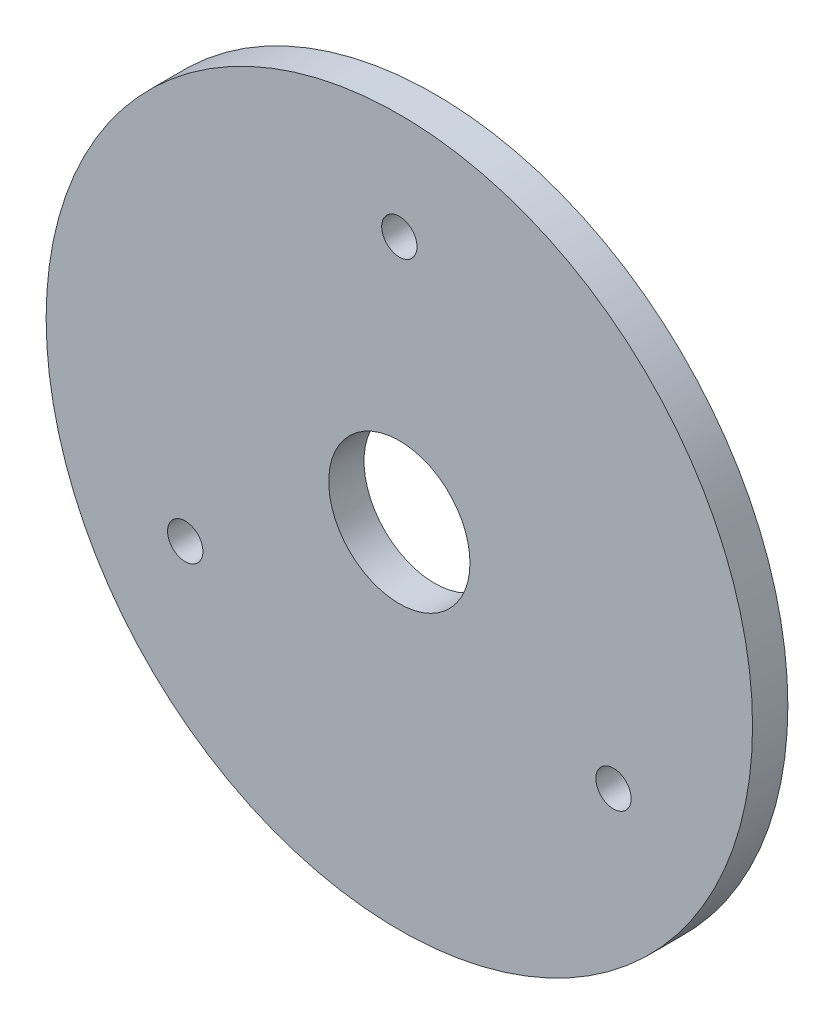
ISO-10303-21;
HEADER;
FILE_DESCRIPTION(('STEP AP214'),'2;1');
FILE_NAME('part.step','',(''),(''),'','','');
FILE_SCHEMA(('AUTOMOTIVE_DESIGN { 1 0 10303 214 1 1 1 1 }'));
ENDSEC;
DATA;
#1=APPLICATION_CONTEXT('core data for automotive mechanical design processes');
#2=APPLICATION_PROTOCOL_DEFINITION('international standard','automotive_design',2000,#1);
#3=PRODUCT_CONTEXT('',#1,'mechanical');
#4=PRODUCT('Part','Part','',(#3));
#5=PRODUCT_RELATED_PRODUCT_CATEGORY('part','',(#4));
#6=PRODUCT_DEFINITION_FORMATION('','',#4);
#7=PRODUCT_DEFINITION_CONTEXT('part definition',#1,'design');
#8=PRODUCT_DEFINITION('design','',#6,#7);
#9=PRODUCT_DEFINITION_SHAPE('','',#8);
#10=(LENGTH_UNIT() NAMED_UNIT(*) SI_UNIT(.MILLI.,.METRE.));
#11=(NAMED_UNIT(*) PLANE_ANGLE_UNIT() SI_UNIT($,.RADIAN.));
#12=(NAMED_UNIT(*) SI_UNIT($,.STERADIAN.) SOLID_ANGLE_UNIT());
#13=UNCERTAINTY_MEASURE_WITH_UNIT(LENGTH_MEASURE(1.E-05),#10,'distance_accuracy_value','');
#14=(GEOMETRIC_REPRESENTATION_CONTEXT(3) GLOBAL_UNCERTAINTY_ASSIGNED_CONTEXT((#13)) GLOBAL_UNIT_ASSIGNED_CONTEXT((#10,
#11,#12)) REPRESENTATION_CONTEXT('',''));
#15=CARTESIAN_POINT('',(0.,0.,0.));
#16=DIRECTION('',(0.,0.,1.));
#17=DIRECTION('',(1.,0.,0.));
#18=AXIS2_PLACEMENT_3D('',#15,#16,#17);
#19=CARTESIAN_POINT('',(0.,0.,2.));
#20=DIRECTION('',(0.,0.,-1.));
#21=DIRECTION('',(-1.,0.,0.));
#22=AXIS2_PLACEMENT_3D('',#19,#20,#21);
#23=CYLINDRICAL_SURFACE('',#22,20.);
#24=CARTESIAN_POINT('',(0.,0.,2.));
#25=DIRECTION('',(0.,0.,1.));
#26=DIRECTION('',(1.,0.,0.));
#27=AXIS2_PLACEMENT_3D('',#24,#25,#26);
#28=CIRCLE('',#27,20.);
#29=CARTESIAN_POINT('',(20.,0.,2.));
#30=VERTEX_POINT('',#29);
#31=EDGE_CURVE('E10',#30,#30,#28,.T.);
#32=ORIENTED_EDGE('',*,*,#31,.F.);
#33=EDGE_LOOP('',(#32));
#34=FACE_BOUND('',#33,.T.);
#35=CARTESIAN_POINT('',(0.,0.,0.));
#36=DIRECTION('',(0.,0.,1.));
#37=DIRECTION('',(1.,0.,0.));
#38=AXIS2_PLACEMENT_3D('',#35,#36,#37);
#39=CIRCLE('',#38,20.);
#40=CARTESIAN_POINT('',(20.,0.,0.));
#41=VERTEX_POINT('',#40);
#42=EDGE_CURVE('E38',#41,#41,#39,.T.);
#43=ORIENTED_EDGE('',*,*,#42,.T.);
#44=EDGE_LOOP('',(#43));
#45=FACE_BOUND('',#44,.T.);
#46=ADVANCED_FACE('F35',(#34,#45),#23,.T.);
#47=CARTESIAN_POINT('',(0.,0.,2.));
#48=DIRECTION('',(0.,0.,1.));
#49=DIRECTION('',(1.,0.,0.));
#50=AXIS2_PLACEMENT_3D('',#47,#48,#49);
#51=PLANE('',#50);
#52=CARTESIAN_POINT('',(0.,0.,2.));
#53=DIRECTION('',(0.,0.,1.));
#54=DIRECTION('',(1.,0.,0.));
#55=AXIS2_PLACEMENT_3D('',#52,#53,#54);
#56=CIRCLE('',#55,4.);
#57=CARTESIAN_POINT('',(4.,0.,2.));
#58=VERTEX_POINT('',#57);
#59=EDGE_CURVE('E65',#58,#58,#56,.T.);
#60=ORIENTED_EDGE('',*,*,#59,.F.);
#61=EDGE_LOOP('',(#60));
#62=FACE_BOUND('',#61,.T.);
#63=CARTESIAN_POINT('',(12.1243556529822,-6.99999999999989,2.));
#64=DIRECTION('',(0.,0.,1.));
#65=DIRECTION('',(-0.499999999999992,-0.866025403784443,0.));
#66=AXIS2_PLACEMENT_3D('',#63,#64,#65);
#67=CIRCLE('',#66,1.);
#68=CARTESIAN_POINT('',(11.6243556529822,-7.86602540378433,2.));
#69=VERTEX_POINT('',#68);
#70=EDGE_CURVE('E59',#69,#69,#67,.T.);
#71=ORIENTED_EDGE('',*,*,#70,.F.);
#72=EDGE_LOOP('',(#71));
#73=FACE_BOUND('',#72,.T.);
#74=CARTESIAN_POINT('',(-12.1243556529821,-7.00000000000006,2.));
#75=DIRECTION('',(0.,0.,1.));
#76=DIRECTION('',(-0.500000000000004,0.866025403784436,0.));
#77=AXIS2_PLACEMENT_3D('',#74,#75,#76);
#78=CIRCLE('',#77,1.);
#79=CARTESIAN_POINT('',(-12.6243556529821,-6.13397459621562,2.));
#80=VERTEX_POINT('',#79);
#81=EDGE_CURVE('E53',#80,#80,#78,.T.);
#82=ORIENTED_EDGE('',*,*,#81,.F.);
#83=EDGE_LOOP('',(#82));
#84=FACE_BOUND('',#83,.T.);
#85=CARTESIAN_POINT('',(0.,14.,2.));
#86=DIRECTION('',(0.,0.,1.));
#87=DIRECTION('',(1.,0.,0.));
#88=AXIS2_PLACEMENT_3D('',#85,#86,#87);
#89=CIRCLE('',#88,1.);
#90=CARTESIAN_POINT('',(1.,14.,2.));
#91=VERTEX_POINT('',#90);
#92=EDGE_CURVE('E47',#91,#91,#89,.T.);
#93=ORIENTED_EDGE('',*,*,#92,.F.);
#94=EDGE_LOOP('',(#93));
#95=FACE_BOUND('',#94,.T.);
#96=ORIENTED_EDGE('',*,*,#31,.T.);
#97=EDGE_LOOP('',(#96));
#98=FACE_BOUND('',#97,.T.);
#99=ADVANCED_FACE('F81',(#62,#73,#84,#95,#98),#51,.T.);
#100=CARTESIAN_POINT('',(0.,0.,0.));
#101=DIRECTION('',(0.,0.,1.));
#102=DIRECTION('',(1.,0.,0.));
#103=AXIS2_PLACEMENT_3D('',#100,#101,#102);
#104=PLANE('',#103);
#105=CARTESIAN_POINT('',(0.,0.,0.));
#106=DIRECTION('',(0.,0.,1.));
#107=DIRECTION('',(1.,0.,0.));
#108=AXIS2_PLACEMENT_3D('',#105,#106,#107);
#109=CIRCLE('',#108,4.);
#110=CARTESIAN_POINT('',(4.,0.,0.));
#111=VERTEX_POINT('',#110);
#112=EDGE_CURVE('E62',#111,#111,#109,.T.);
#113=ORIENTED_EDGE('',*,*,#112,.T.);
#114=EDGE_LOOP('',(#113));
#115=FACE_BOUND('',#114,.T.);
#116=CARTESIAN_POINT('',(12.1243556529822,-6.99999999999989,0.));
#117=DIRECTION('',(0.,0.,1.));
#118=DIRECTION('',(-0.499999999999992,-0.866025403784443,0.));
#119=AXIS2_PLACEMENT_3D('',#116,#117,#118);
#120=CIRCLE('',#119,1.);
#121=CARTESIAN_POINT('',(11.6243556529822,-7.86602540378433,0.));
#122=VERTEX_POINT('',#121);
#123=EDGE_CURVE('E56',#122,#122,#120,.T.);
#124=ORIENTED_EDGE('',*,*,#123,.T.);
#125=EDGE_LOOP('',(#124));
#126=FACE_BOUND('',#125,.T.);
#127=CARTESIAN_POINT('',(-12.1243556529821,-7.00000000000006,0.));
#128=DIRECTION('',(0.,0.,1.));
#129=DIRECTION('',(-0.500000000000004,0.866025403784436,0.));
#130=AXIS2_PLACEMENT_3D('',#127,#128,#129);
#131=CIRCLE('',#130,1.);
#132=CARTESIAN_POINT('',(-12.6243556529821,-6.13397459621562,0.));
#133=VERTEX_POINT('',#132);
#134=EDGE_CURVE('E50',#133,#133,#131,.T.);
#135=ORIENTED_EDGE('',*,*,#134,.T.);
#136=EDGE_LOOP('',(#135));
#137=FACE_BOUND('',#136,.T.);
#138=CARTESIAN_POINT('',(0.,14.,0.));
#139=DIRECTION('',(0.,0.,1.));
#140=DIRECTION('',(1.,0.,0.));
#141=AXIS2_PLACEMENT_3D('',#138,#139,#140);
#142=CIRCLE('',#141,1.);
#143=CARTESIAN_POINT('',(1.,14.,0.));
#144=VERTEX_POINT('',#143);
#145=EDGE_CURVE('E45',#144,#144,#142,.T.);
#146=ORIENTED_EDGE('',*,*,#145,.T.);
#147=EDGE_LOOP('',(#146));
#148=FACE_BOUND('',#147,.T.);
#149=ORIENTED_EDGE('',*,*,#42,.F.);
#150=EDGE_LOOP('',(#149));
#151=FACE_BOUND('',#150,.T.);
#152=ADVANCED_FACE('F71',(#115,#126,#137,#148,#151),#104,.F.);
#153=CARTESIAN_POINT('',(0.,14.,0.));
#154=DIRECTION('',(0.,0.,1.));
#155=DIRECTION('',(1.,0.,0.));
#156=AXIS2_PLACEMENT_3D('',#153,#154,#155);
#157=CYLINDRICAL_SURFACE('',#156,1.);
#158=ORIENTED_EDGE('',*,*,#145,.F.);
#159=EDGE_LOOP('',(#158));
#160=FACE_BOUND('',#159,.T.);
#161=ORIENTED_EDGE('',*,*,#92,.T.);
#162=EDGE_LOOP('',(#161));
#163=FACE_BOUND('',#162,.T.);
#164=ADVANCED_FACE('F91',(#160,#163),#157,.F.);
#165=CARTESIAN_POINT('',(-12.1243556529821,-7.00000000000006,0.));
#166=DIRECTION('',(0.,0.,1.));
#167=DIRECTION('',(1.,0.,0.));
#168=AXIS2_PLACEMENT_3D('',#165,#166,#167);
#169=CYLINDRICAL_SURFACE('',#168,1.);
#170=ORIENTED_EDGE('',*,*,#134,.F.);
#171=EDGE_LOOP('',(#170));
#172=FACE_BOUND('',#171,.T.);
#173=ORIENTED_EDGE('',*,*,#81,.T.);
#174=EDGE_LOOP('',(#173));
#175=FACE_BOUND('',#174,.T.);
#176=ADVANCED_FACE('F93',(#172,#175),#169,.F.);
#177=CARTESIAN_POINT('',(12.1243556529822,-6.99999999999989,0.));
#178=DIRECTION('',(0.,0.,1.));
#179=DIRECTION('',(1.,0.,0.));
#180=AXIS2_PLACEMENT_3D('',#177,#178,#179);
#181=CYLINDRICAL_SURFACE('',#180,1.);
#182=ORIENTED_EDGE('',*,*,#123,.F.);
#183=EDGE_LOOP('',(#182));
#184=FACE_BOUND('',#183,.T.);
#185=ORIENTED_EDGE('',*,*,#70,.T.);
#186=EDGE_LOOP('',(#185));
#187=FACE_BOUND('',#186,.T.);
#188=ADVANCED_FACE('F77',(#184,#187),#181,.F.);
#189=CARTESIAN_POINT('',(0.,0.,0.));
#190=DIRECTION('',(0.,0.,1.));
#191=DIRECTION('',(1.,0.,0.));
#192=AXIS2_PLACEMENT_3D('',#189,#190,#191);
#193=CYLINDRICAL_SURFACE('',#192,4.);
#194=ORIENTED_EDGE('',*,*,#112,.F.);
#195=EDGE_LOOP('',(#194));
#196=FACE_BOUND('',#195,.T.);
#197=ORIENTED_EDGE('',*,*,#59,.T.);
#198=EDGE_LOOP('',(#197));
#199=FACE_BOUND('',#198,.T.);
#200=ADVANCED_FACE('F74',(#196,#199),#193,.F.);
#201=CLOSED_SHELL('',(#46,#99,#152,#164,#176,#188,#200));
#202=MANIFOLD_SOLID_BREP('B2',#201);
#203=ADVANCED_BREP_SHAPE_REPRESENTATION('',(#18,#202),#14);
#204=SHAPE_DEFINITION_REPRESENTATION(#9,#203);
ENDSEC;
END-ISO-10303-21;
